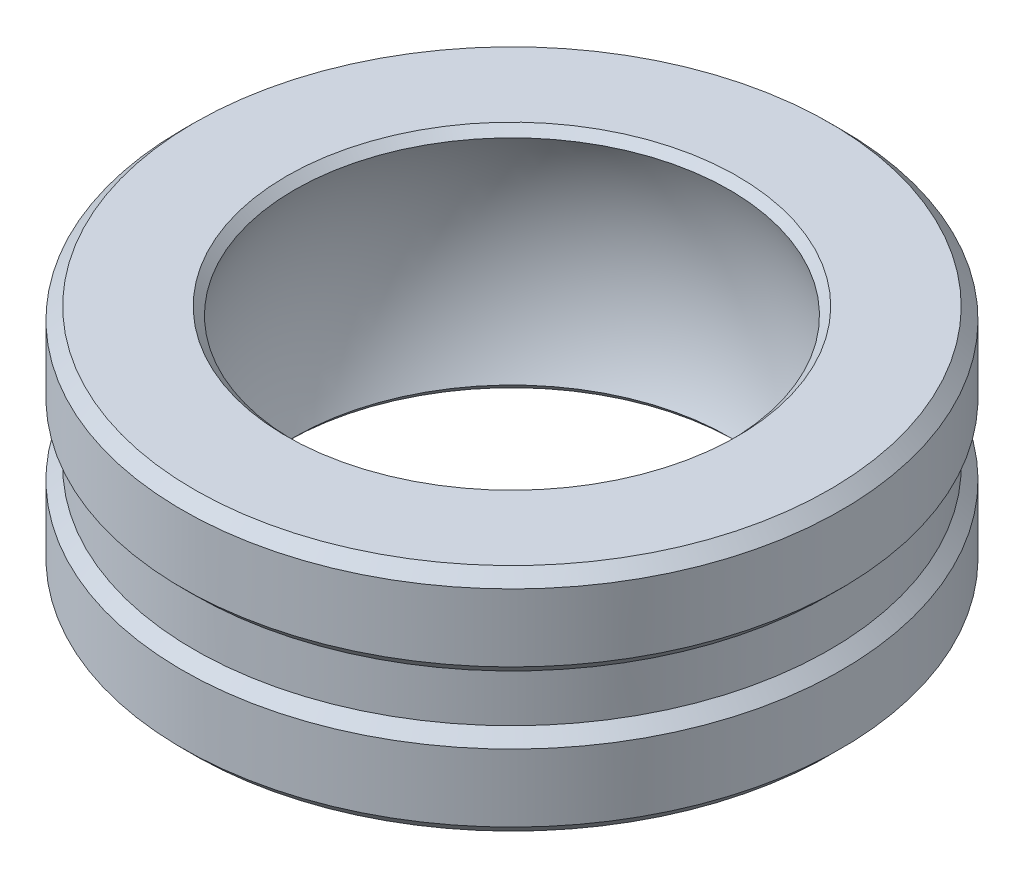
ISO-10303-21;
HEADER;
FILE_DESCRIPTION(('STEP AP214'),'2;1');
FILE_NAME('part.step','',(''),(''),'','','');
FILE_SCHEMA(('AUTOMOTIVE_DESIGN { 1 0 10303 214 1 1 1 1 }'));
ENDSEC;
DATA;
#1=APPLICATION_CONTEXT('core data for automotive mechanical design processes');
#2=APPLICATION_PROTOCOL_DEFINITION('international standard','automotive_design',2000,#1);
#3=PRODUCT_CONTEXT('',#1,'mechanical');
#4=PRODUCT('Part','Part','',(#3));
#5=PRODUCT_RELATED_PRODUCT_CATEGORY('part','',(#4));
#6=PRODUCT_DEFINITION_FORMATION('','',#4);
#7=PRODUCT_DEFINITION_CONTEXT('part definition',#1,'design');
#8=PRODUCT_DEFINITION('design','',#6,#7);
#9=PRODUCT_DEFINITION_SHAPE('','',#8);
#10=(LENGTH_UNIT() NAMED_UNIT(*) SI_UNIT(.MILLI.,.METRE.));
#11=(NAMED_UNIT(*) PLANE_ANGLE_UNIT() SI_UNIT($,.RADIAN.));
#12=(NAMED_UNIT(*) SI_UNIT($,.STERADIAN.) SOLID_ANGLE_UNIT());
#13=UNCERTAINTY_MEASURE_WITH_UNIT(LENGTH_MEASURE(1.E-05),#10,'distance_accuracy_value','');
#14=(GEOMETRIC_REPRESENTATION_CONTEXT(3) GLOBAL_UNCERTAINTY_ASSIGNED_CONTEXT((#13)) GLOBAL_UNIT_ASSIGNED_CONTEXT((#10,
#11,#12)) REPRESENTATION_CONTEXT('',''));
#15=CARTESIAN_POINT('',(0.,0.,0.));
#16=DIRECTION('',(0.,0.,1.));
#17=DIRECTION('',(1.,0.,0.));
#18=AXIS2_PLACEMENT_3D('',#15,#16,#17);
#19=CARTESIAN_POINT('',(0.,-995.342254743348,0.));
#20=DIRECTION('',(0.,-1.,0.));
#21=DIRECTION('',(-0.859265355942877,0.,-0.511530104760571));
#22=AXIS2_PLACEMENT_3D('',#19,#20,#21);
#23=CONICAL_SURFACE('',#22,1000.,0.78539816339745);
#24=CARTESIAN_POINT('',(0.,-4.85,0.));
#25=DIRECTION('',(0.,1.,0.));
#26=DIRECTION('',(-1.,0.,0.));
#27=AXIS2_PLACEMENT_3D('',#24,#25,#26);
#28=CIRCLE('',#27,9.50774525664926);
#29=CARTESIAN_POINT('',(-9.50774525664926,-4.85,0.));
#30=VERTEX_POINT('',#29);
#31=EDGE_CURVE('E9',#30,#30,#28,.T.);
#32=ORIENTED_EDGE('',*,*,#31,.F.);
#33=EDGE_LOOP('',(#32));
#34=FACE_BOUND('',#33,.T.);
#35=CARTESIAN_POINT('',(0.,-4.51492765229726,0.));
#36=DIRECTION('',(0.,1.,0.));
#37=DIRECTION('',(-1.,0.,0.));
#38=AXIS2_PLACEMENT_3D('',#35,#36,#37);
#39=CIRCLE('',#38,9.17267290894653);
#40=CARTESIAN_POINT('',(-9.17267290894653,-4.51492765229726,0.));
#41=VERTEX_POINT('',#40);
#42=EDGE_CURVE('E18',#41,#41,#39,.T.);
#43=ORIENTED_EDGE('',*,*,#42,.T.);
#44=EDGE_LOOP('',(#43));
#45=FACE_BOUND('',#44,.T.);
#46=ADVANCED_FACE('F14',(#34,#45),#23,.F.);
#47=CARTESIAN_POINT('',(0.,-4.85,0.));
#48=DIRECTION('',(0.,1.,0.));
#49=DIRECTION('',(1.,0.,0.));
#50=AXIS2_PLACEMENT_3D('',#47,#48,#49);
#51=PLANE('',#50);
#52=ORIENTED_EDGE('',*,*,#31,.T.);
#53=EDGE_LOOP('',(#52));
#54=FACE_BOUND('',#53,.T.);
#55=CARTESIAN_POINT('',(0.,-4.85000000000014,0.));
#56=DIRECTION('',(0.,1.,0.));
#57=DIRECTION('',(-1.,0.,0.));
#58=AXIS2_PLACEMENT_3D('',#55,#56,#57);
#59=CIRCLE('',#58,13.4);
#60=CARTESIAN_POINT('',(-13.4,-4.85000000000014,0.));
#61=VERTEX_POINT('',#60);
#62=EDGE_CURVE('E33',#61,#61,#59,.T.);
#63=ORIENTED_EDGE('',*,*,#62,.F.);
#64=EDGE_LOOP('',(#63));
#65=FACE_BOUND('',#64,.T.);
#66=ADVANCED_FACE('F16',(#54,#65),#51,.F.);
#67=CARTESIAN_POINT('',(0.,0.,0.));
#68=DIRECTION('',(0.,1.,0.));
#69=DIRECTION('',(-1.,0.,0.));
#70=AXIS2_PLACEMENT_3D('',#67,#68,#69);
#71=SPHERICAL_SURFACE('',#70,10.2236246018719);
#72=CARTESIAN_POINT('',(0.,4.51492765229721,0.));
#73=DIRECTION('',(0.,1.,0.));
#74=DIRECTION('',(0.899826433262327,0.,0.436248083093094));
#75=AXIS2_PLACEMENT_3D('',#72,#73,#74);
#76=CIRCLE('',#75,9.17267290894652);
#77=CARTESIAN_POINT('',(8.25381354713932,4.51492765229721,4.00156097336787));
#78=VERTEX_POINT('',#77);
#79=EDGE_CURVE('E59',#78,#78,#76,.T.);
#80=ORIENTED_EDGE('',*,*,#79,.T.);
#81=EDGE_LOOP('',(#80));
#82=FACE_BOUND('',#81,.T.);
#83=ORIENTED_EDGE('',*,*,#42,.F.);
#84=EDGE_LOOP('',(#83));
#85=FACE_BOUND('',#84,.T.);
#86=ADVANCED_FACE('F76',(#82,#85),#71,.F.);
#87=CARTESIAN_POINT('',(5.25499643799768E-12,981.749999999984,-1.57658774924127E-11));
#88=DIRECTION('',(0.,1.,0.));
#89=DIRECTION('',(-1.,0.,0.));
#90=AXIS2_PLACEMENT_3D('',#87,#88,#89);
#91=CONICAL_SURFACE('',#90,1000.,0.785398163397456);
#92=ORIENTED_EDGE('',*,*,#62,.T.);
#93=EDGE_LOOP('',(#92));
#94=FACE_BOUND('',#93,.T.);
#95=CARTESIAN_POINT('',(0.,-4.35,0.));
#96=DIRECTION('',(0.,1.,0.));
#97=DIRECTION('',(-1.,0.,0.));
#98=AXIS2_PLACEMENT_3D('',#95,#96,#97);
#99=CIRCLE('',#98,13.9);
#100=CARTESIAN_POINT('',(-13.9,-4.35,0.));
#101=VERTEX_POINT('',#100);
#102=EDGE_CURVE('E63',#101,#101,#99,.T.);
#103=ORIENTED_EDGE('',*,*,#102,.F.);
#104=EDGE_LOOP('',(#103));
#105=FACE_BOUND('',#104,.T.);
#106=ADVANCED_FACE('F72',(#94,#105),#91,.T.);
#107=CARTESIAN_POINT('',(0.,0.,0.));
#108=DIRECTION('',(0.,1.,0.));
#109=DIRECTION('',(-1.,0.,0.));
#110=AXIS2_PLACEMENT_3D('',#107,#108,#109);
#111=CYLINDRICAL_SURFACE('',#110,13.9);
#112=ORIENTED_EDGE('',*,*,#102,.T.);
#113=EDGE_LOOP('',(#112));
#114=FACE_BOUND('',#113,.T.);
#115=CARTESIAN_POINT('',(0.,-1.50000000000008,0.));
#116=DIRECTION('',(0.,1.,0.));
#117=DIRECTION('',(-0.900480715631901,0.,-0.434895942467918));
#118=AXIS2_PLACEMENT_3D('',#115,#116,#117);
#119=CIRCLE('',#118,13.9);
#120=CARTESIAN_POINT('',(-12.5166819472834,-1.50000000000008,-6.04505360030406));
#121=VERTEX_POINT('',#120);
#122=EDGE_CURVE('E46',#121,#121,#119,.T.);
#123=ORIENTED_EDGE('',*,*,#122,.F.);
#124=EDGE_LOOP('',(#123));
#125=FACE_BOUND('',#124,.T.);
#126=ADVANCED_FACE('F91',(#114,#125),#111,.T.);
#127=CARTESIAN_POINT('',(0.,995.342254743348,0.));
#128=DIRECTION('',(0.,1.,0.));
#129=DIRECTION('',(-0.859265355942877,0.,-0.511530104760571));
#130=AXIS2_PLACEMENT_3D('',#127,#128,#129);
#131=CONICAL_SURFACE('',#130,1000.,0.78539816339745);
#132=CARTESIAN_POINT('',(0.,4.85,0.));
#133=DIRECTION('',(0.,1.,0.));
#134=DIRECTION('',(-1.,0.,0.));
#135=AXIS2_PLACEMENT_3D('',#132,#133,#134);
#136=CIRCLE('',#135,9.50774525664926);
#137=CARTESIAN_POINT('',(-9.50774525664926,4.85,0.));
#138=VERTEX_POINT('',#137);
#139=EDGE_CURVE('E55',#138,#138,#136,.T.);
#140=ORIENTED_EDGE('',*,*,#139,.T.);
#141=EDGE_LOOP('',(#140));
#142=FACE_BOUND('',#141,.T.);
#143=ORIENTED_EDGE('',*,*,#79,.F.);
#144=EDGE_LOOP('',(#143));
#145=FACE_BOUND('',#144,.T.);
#146=ADVANCED_FACE('F93',(#142,#145),#131,.F.);
#147=CARTESIAN_POINT('',(0.,4.85,0.));
#148=DIRECTION('',(0.,1.,0.));
#149=DIRECTION('',(1.,0.,0.));
#150=AXIS2_PLACEMENT_3D('',#147,#148,#149);
#151=PLANE('',#150);
#152=ORIENTED_EDGE('',*,*,#139,.F.);
#153=EDGE_LOOP('',(#152));
#154=FACE_BOUND('',#153,.T.);
#155=CARTESIAN_POINT('',(0.,4.84999999999987,0.));
#156=DIRECTION('',(0.,1.,0.));
#157=DIRECTION('',(0.992012757326069,0.,0.12613758084857));
#158=AXIS2_PLACEMENT_3D('',#155,#156,#157);
#159=CIRCLE('',#158,13.4);
#160=CARTESIAN_POINT('',(13.2929709481693,4.84999999999987,1.69024358337084));
#161=VERTEX_POINT('',#160);
#162=EDGE_CURVE('E51',#161,#161,#159,.T.);
#163=ORIENTED_EDGE('',*,*,#162,.T.);
#164=EDGE_LOOP('',(#163));
#165=FACE_BOUND('',#164,.T.);
#166=ADVANCED_FACE('F98',(#154,#165),#151,.T.);
#167=CARTESIAN_POINT('',(5.25499643799768E-12,-981.749999999984,-1.57658774924127E-11));
#168=DIRECTION('',(0.,-1.,0.));
#169=DIRECTION('',(-1.,0.,0.));
#170=AXIS2_PLACEMENT_3D('',#167,#168,#169);
#171=CONICAL_SURFACE('',#170,1000.,0.785398163397456);
#172=ORIENTED_EDGE('',*,*,#162,.F.);
#173=EDGE_LOOP('',(#172));
#174=FACE_BOUND('',#173,.T.);
#175=CARTESIAN_POINT('',(0.,4.35,0.));
#176=DIRECTION('',(0.,1.,0.));
#177=DIRECTION('',(-1.,0.,0.));
#178=AXIS2_PLACEMENT_3D('',#175,#176,#177);
#179=CIRCLE('',#178,13.9);
#180=CARTESIAN_POINT('',(-13.9,4.35,0.));
#181=VERTEX_POINT('',#180);
#182=EDGE_CURVE('E47',#181,#181,#179,.T.);
#183=ORIENTED_EDGE('',*,*,#182,.T.);
#184=EDGE_LOOP('',(#183));
#185=FACE_BOUND('',#184,.T.);
#186=ADVANCED_FACE('F102',(#174,#185),#171,.T.);
#187=CARTESIAN_POINT('',(0.,0.,0.));
#188=DIRECTION('',(0.,1.,0.));
#189=DIRECTION('',(-1.,0.,0.));
#190=AXIS2_PLACEMENT_3D('',#187,#188,#189);
#191=CYLINDRICAL_SURFACE('',#190,13.9);
#192=CARTESIAN_POINT('',(0.,1.5,0.));
#193=DIRECTION('',(0.,1.,0.));
#194=DIRECTION('',(0.947475654139455,0.,0.319827898740887));
#195=AXIS2_PLACEMENT_3D('',#192,#193,#194);
#196=CIRCLE('',#195,13.9);
#197=CARTESIAN_POINT('',(13.1699115925384,1.5,4.44560779249833));
#198=VERTEX_POINT('',#197);
#199=EDGE_CURVE('E36',#198,#198,#196,.T.);
#200=ORIENTED_EDGE('',*,*,#199,.T.);
#201=EDGE_LOOP('',(#200));
#202=FACE_BOUND('',#201,.T.);
#203=ORIENTED_EDGE('',*,*,#182,.F.);
#204=EDGE_LOOP('',(#203));
#205=FACE_BOUND('',#204,.T.);
#206=ADVANCED_FACE('F106',(#202,#205),#191,.T.);
#207=CARTESIAN_POINT('',(1.05135455896744E-11,-987.6,8.75832739666298E-12));
#208=DIRECTION('',(0.,-1.,0.));
#209=DIRECTION('',(0.947475654139439,0.,0.319827898740934));
#210=AXIS2_PLACEMENT_3D('',#207,#208,#209);
#211=CONICAL_SURFACE('',#210,1000.,0.785398163397446);
#212=CARTESIAN_POINT('',(0.,-1.,0.));
#213=DIRECTION('',(0.,1.,0.));
#214=DIRECTION('',(-1.,0.,0.));
#215=AXIS2_PLACEMENT_3D('',#212,#213,#214);
#216=CIRCLE('',#215,13.4);
#217=CARTESIAN_POINT('',(-13.4,-1.,0.));
#218=VERTEX_POINT('',#217);
#219=EDGE_CURVE('E42',#218,#218,#216,.T.);
#220=ORIENTED_EDGE('',*,*,#219,.F.);
#221=EDGE_LOOP('',(#220));
#222=FACE_BOUND('',#221,.T.);
#223=ORIENTED_EDGE('',*,*,#122,.T.);
#224=EDGE_LOOP('',(#223));
#225=FACE_BOUND('',#224,.T.);
#226=ADVANCED_FACE('F110',(#222,#225),#211,.T.);
#227=CARTESIAN_POINT('',(0.,-4.85,0.));
#228=DIRECTION('',(0.,1.,0.));
#229=DIRECTION('',(1.,0.,0.));
#230=AXIS2_PLACEMENT_3D('',#227,#228,#229);
#231=CYLINDRICAL_SURFACE('',#230,13.4);
#232=ORIENTED_EDGE('',*,*,#219,.T.);
#233=EDGE_LOOP('',(#232));
#234=FACE_BOUND('',#233,.T.);
#235=CARTESIAN_POINT('',(0.,1.00000000000004,0.));
#236=DIRECTION('',(0.,1.,0.));
#237=DIRECTION('',(-0.900480715631901,0.,-0.434895942467919));
#238=AXIS2_PLACEMENT_3D('',#235,#236,#237);
#239=CIRCLE('',#238,13.4);
#240=CARTESIAN_POINT('',(-12.0664415894675,1.00000000000004,-5.82760562907011));
#241=VERTEX_POINT('',#240);
#242=EDGE_CURVE('E38',#241,#241,#239,.T.);
#243=ORIENTED_EDGE('',*,*,#242,.F.);
#244=EDGE_LOOP('',(#243));
#245=FACE_BOUND('',#244,.T.);
#246=ADVANCED_FACE('F114',(#234,#245),#231,.T.);
#247=CARTESIAN_POINT('',(0.,987.6,1.75344183617199E-12));
#248=DIRECTION('',(0.,1.,0.));
#249=DIRECTION('',(0.947475654139455,0.,0.319827898740887));
#250=AXIS2_PLACEMENT_3D('',#247,#248,#249);
#251=CONICAL_SURFACE('',#250,1000.,0.785398163397448);
#252=ORIENTED_EDGE('',*,*,#242,.T.);
#253=EDGE_LOOP('',(#252));
#254=FACE_BOUND('',#253,.T.);
#255=ORIENTED_EDGE('',*,*,#199,.F.);
#256=EDGE_LOOP('',(#255));
#257=FACE_BOUND('',#256,.T.);
#258=ADVANCED_FACE('F118',(#254,#257),#251,.T.);
#259=CLOSED_SHELL('',(#46,#66,#86,#106,#126,#146,#166,#186,#206,#226,#246,#258));
#260=MANIFOLD_SOLID_BREP('B1',#259);
#261=ADVANCED_BREP_SHAPE_REPRESENTATION('',(#18,#260),#14);
#262=SHAPE_DEFINITION_REPRESENTATION(#9,#261);
ENDSEC;
END-ISO-10303-21;
